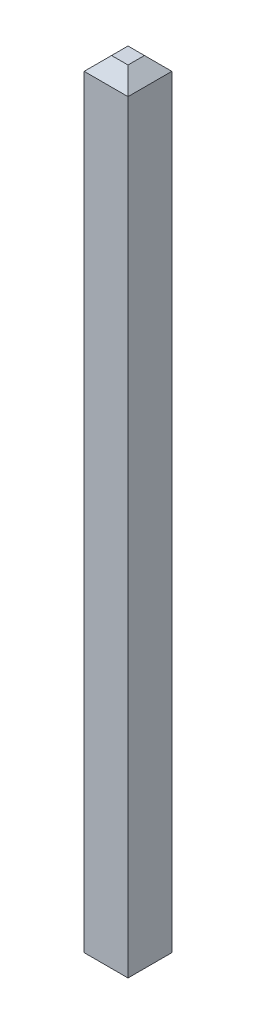
ISO-10303-21;
HEADER;
FILE_DESCRIPTION(('STEP AP214'),'2;1');
FILE_NAME('part.step','',(''),(''),'','','');
FILE_SCHEMA(('AUTOMOTIVE_DESIGN { 1 0 10303 214 1 1 1 1 }'));
ENDSEC;
DATA;
#1=APPLICATION_CONTEXT('core data for automotive mechanical design processes');
#2=APPLICATION_PROTOCOL_DEFINITION('international standard','automotive_design',2000,#1);
#3=PRODUCT_CONTEXT('',#1,'mechanical');
#4=PRODUCT('Part','Part','',(#3));
#5=PRODUCT_RELATED_PRODUCT_CATEGORY('part','',(#4));
#6=PRODUCT_DEFINITION_FORMATION('','',#4);
#7=PRODUCT_DEFINITION_CONTEXT('part definition',#1,'design');
#8=PRODUCT_DEFINITION('design','',#6,#7);
#9=PRODUCT_DEFINITION_SHAPE('','',#8);
#10=(LENGTH_UNIT() NAMED_UNIT(*) SI_UNIT(.MILLI.,.METRE.));
#11=(NAMED_UNIT(*) PLANE_ANGLE_UNIT() SI_UNIT($,.RADIAN.));
#12=(NAMED_UNIT(*) SI_UNIT($,.STERADIAN.) SOLID_ANGLE_UNIT());
#13=UNCERTAINTY_MEASURE_WITH_UNIT(LENGTH_MEASURE(1.E-05),#10,'distance_accuracy_value','');
#14=(GEOMETRIC_REPRESENTATION_CONTEXT(3) GLOBAL_UNCERTAINTY_ASSIGNED_CONTEXT((#13)) GLOBAL_UNIT_ASSIGNED_CONTEXT((#10,
#11,#12)) REPRESENTATION_CONTEXT('',''));
#15=CARTESIAN_POINT('',(0.,0.,0.));
#16=DIRECTION('',(0.,0.,1.));
#17=DIRECTION('',(1.,0.,0.));
#18=AXIS2_PLACEMENT_3D('',#15,#16,#17);
#19=CARTESIAN_POINT('',(1.59,7.07,-0.32));
#20=DIRECTION('',(-0.707106781186548,-0.707106781186548,0.));
#21=DIRECTION('',(-0.707106781186548,0.707106781186548,0.));
#22=AXIS2_PLACEMENT_3D('',#19,#20,#21);
#23=PLANE('',#22);
#24=DIRECTION('',(0.577350269189626,-0.577350269189626,0.577350269189626));
#25=VECTOR('',#24,1.);
#26=CARTESIAN_POINT('',(1.376666666667,7.283333333333,0.106666666667));
#27=LINE('',#26,#25);
#28=CARTESIAN_POINT('',(1.39,7.27,0.12));
#29=VERTEX_POINT('',#28);
#30=CARTESIAN_POINT('',(1.59,7.07,0.32));
#31=VERTEX_POINT('',#30);
#32=EDGE_CURVE('E160',#29,#31,#27,.T.);
#33=ORIENTED_EDGE('',*,*,#32,.T.);
#34=DIRECTION('',(0.,0.,1.));
#35=VECTOR('',#34,1.);
#36=CARTESIAN_POINT('',(1.59,7.07,-0.32));
#37=LINE('',#36,#35);
#38=CARTESIAN_POINT('',(1.59,7.07,-0.32));
#39=VERTEX_POINT('',#38);
#40=EDGE_CURVE('E161',#39,#31,#37,.T.);
#41=ORIENTED_EDGE('',*,*,#40,.F.);
#42=DIRECTION('',(0.577350269189626,-0.577350269189626,-0.577350269189626));
#43=VECTOR('',#42,1.);
#44=CARTESIAN_POINT('',(1.59,7.07,-0.32));
#45=LINE('',#44,#43);
#46=CARTESIAN_POINT('',(1.39,7.27,-0.12));
#47=VERTEX_POINT('',#46);
#48=EDGE_CURVE('E11',#47,#39,#45,.T.);
#49=ORIENTED_EDGE('',*,*,#48,.F.);
#50=DIRECTION('',(0.,0.,-1.));
#51=VECTOR('',#50,1.);
#52=CARTESIAN_POINT('',(1.39,7.27,-0.32));
#53=LINE('',#52,#51);
#54=EDGE_CURVE('E141',#29,#47,#53,.T.);
#55=ORIENTED_EDGE('',*,*,#54,.F.);
#56=EDGE_LOOP('',(#33,#41,#49,#55));
#57=FACE_BOUND('',#56,.T.);
#58=ADVANCED_FACE('F16',(#57),#23,.F.);
#59=CARTESIAN_POINT('',(1.27,7.07,-0.32));
#60=DIRECTION('',(0.,0.707106781186548,-0.707106781186548));
#61=DIRECTION('',(-1.,0.,0.));
#62=AXIS2_PLACEMENT_3D('',#59,#60,#61);
#63=PLANE('',#62);
#64=DIRECTION('',(0.577350269189626,0.577350269189626,0.577350269189626));
#65=VECTOR('',#64,1.);
#66=CARTESIAN_POINT('',(1.083333333333,7.203333333333,-0.186666666667));
#67=LINE('',#66,#65);
#68=CARTESIAN_POINT('',(0.95,7.07,-0.32));
#69=VERTEX_POINT('',#68);
#70=CARTESIAN_POINT('',(1.15,7.27,-0.12));
#71=VERTEX_POINT('',#70);
#72=EDGE_CURVE('E27',#69,#71,#67,.T.);
#73=ORIENTED_EDGE('',*,*,#72,.T.);
#74=DIRECTION('',(-1.,0.,0.));
#75=VECTOR('',#74,1.);
#76=CARTESIAN_POINT('',(0.95,7.27,-0.12));
#77=LINE('',#76,#75);
#78=EDGE_CURVE('E137',#47,#71,#77,.T.);
#79=ORIENTED_EDGE('',*,*,#78,.F.);
#80=ORIENTED_EDGE('',*,*,#48,.T.);
#81=DIRECTION('',(1.,0.,0.));
#82=VECTOR('',#81,1.);
#83=CARTESIAN_POINT('',(1.59,7.07,-0.32));
#84=LINE('',#83,#82);
#85=EDGE_CURVE('E112',#69,#39,#84,.T.);
#86=ORIENTED_EDGE('',*,*,#85,.F.);
#87=EDGE_LOOP('',(#73,#79,#80,#86));
#88=FACE_BOUND('',#87,.T.);
#89=ADVANCED_FACE('F203',(#88),#63,.T.);
#90=CARTESIAN_POINT('',(1.15,7.27,-0.32));
#91=DIRECTION('',(0.707106781186548,-0.707106781186548,0.));
#92=DIRECTION('',(0.,0.,-1.));
#93=AXIS2_PLACEMENT_3D('',#90,#91,#92);
#94=PLANE('',#93);
#95=DIRECTION('',(-0.577350269189626,-0.577350269189626,0.577350269189626));
#96=VECTOR('',#95,1.);
#97=CARTESIAN_POINT('',(1.083333333333,7.203333333333,0.186666666667));
#98=LINE('',#97,#96);
#99=CARTESIAN_POINT('',(1.15,7.27,0.12));
#100=VERTEX_POINT('',#99);
#101=CARTESIAN_POINT('',(0.95,7.07,0.32));
#102=VERTEX_POINT('',#101);
#103=EDGE_CURVE('E41',#100,#102,#98,.T.);
#104=ORIENTED_EDGE('',*,*,#103,.F.);
#105=DIRECTION('',(0.,0.,1.));
#106=VECTOR('',#105,1.);
#107=CARTESIAN_POINT('',(1.15,7.27,-0.32));
#108=LINE('',#107,#106);
#109=EDGE_CURVE('E140',#71,#100,#108,.T.);
#110=ORIENTED_EDGE('',*,*,#109,.F.);
#111=ORIENTED_EDGE('',*,*,#72,.F.);
#112=DIRECTION('',(0.,0.,-1.));
#113=VECTOR('',#112,1.);
#114=CARTESIAN_POINT('',(0.95,7.07,-0.32));
#115=LINE('',#114,#113);
#116=EDGE_CURVE('E176',#102,#69,#115,.T.);
#117=ORIENTED_EDGE('',*,*,#116,.F.);
#118=EDGE_LOOP('',(#104,#110,#111,#117));
#119=FACE_BOUND('',#118,.T.);
#120=ADVANCED_FACE('F204',(#119),#94,.F.);
#121=CARTESIAN_POINT('',(0.95,7.27,0.12));
#122=DIRECTION('',(0.,-0.707106781186548,-0.707106781186548));
#123=DIRECTION('',(0.,-0.707106781186548,0.707106781186548));
#124=AXIS2_PLACEMENT_3D('',#121,#122,#123);
#125=PLANE('',#124);
#126=ORIENTED_EDGE('',*,*,#32,.F.);
#127=DIRECTION('',(1.,0.,0.));
#128=VECTOR('',#127,1.);
#129=CARTESIAN_POINT('',(0.95,7.27,0.12));
#130=LINE('',#129,#128);
#131=EDGE_CURVE('E166',#100,#29,#130,.T.);
#132=ORIENTED_EDGE('',*,*,#131,.F.);
#133=ORIENTED_EDGE('',*,*,#103,.T.);
#134=DIRECTION('',(-1.,0.,0.));
#135=VECTOR('',#134,1.);
#136=CARTESIAN_POINT('',(1.27,7.07,0.32));
#137=LINE('',#136,#135);
#138=EDGE_CURVE('E150',#31,#102,#137,.T.);
#139=ORIENTED_EDGE('',*,*,#138,.F.);
#140=EDGE_LOOP('',(#126,#132,#133,#139));
#141=FACE_BOUND('',#140,.T.);
#142=ADVANCED_FACE('F215',(#141),#125,.F.);
#143=CARTESIAN_POINT('',(0.95,7.27,-0.32));
#144=DIRECTION('',(0.,-1.,0.));
#145=DIRECTION('',(0.,0.,-1.));
#146=AXIS2_PLACEMENT_3D('',#143,#144,#145);
#147=PLANE('',#146);
#148=ORIENTED_EDGE('',*,*,#54,.T.);
#149=ORIENTED_EDGE('',*,*,#78,.T.);
#150=ORIENTED_EDGE('',*,*,#109,.T.);
#151=ORIENTED_EDGE('',*,*,#131,.T.);
#152=EDGE_LOOP('',(#148,#149,#150,#151));
#153=FACE_BOUND('',#152,.T.);
#154=ADVANCED_FACE('F206',(#153),#147,.F.);
#155=CARTESIAN_POINT('',(1.59,7.27,-0.32));
#156=DIRECTION('',(-1.,0.,0.));
#157=DIRECTION('',(0.,1.,0.));
#158=AXIS2_PLACEMENT_3D('',#155,#156,#157);
#159=PLANE('',#158);
#160=DIRECTION('',(0.,-1.,0.));
#161=VECTOR('',#160,1.);
#162=CARTESIAN_POINT('',(1.59,7.27,-0.32));
#163=LINE('',#162,#161);
#164=CARTESIAN_POINT('',(1.59,-4.07,-0.32));
#165=VERTEX_POINT('',#164);
#166=EDGE_CURVE('E93',#39,#165,#163,.T.);
#167=ORIENTED_EDGE('',*,*,#166,.F.);
#168=ORIENTED_EDGE('',*,*,#40,.T.);
#169=DIRECTION('',(0.,-1.,0.));
#170=VECTOR('',#169,1.);
#171=CARTESIAN_POINT('',(1.59,7.27,0.32));
#172=LINE('',#171,#170);
#173=CARTESIAN_POINT('',(1.59,-4.07,0.32));
#174=VERTEX_POINT('',#173);
#175=EDGE_CURVE('E96',#31,#174,#172,.T.);
#176=ORIENTED_EDGE('',*,*,#175,.T.);
#177=DIRECTION('',(0.,0.,-1.));
#178=VECTOR('',#177,1.);
#179=CARTESIAN_POINT('',(1.59,-4.07,-0.32));
#180=LINE('',#179,#178);
#181=EDGE_CURVE('E90',#174,#165,#180,.T.);
#182=ORIENTED_EDGE('',*,*,#181,.T.);
#183=EDGE_LOOP('',(#167,#168,#176,#182));
#184=FACE_BOUND('',#183,.T.);
#185=ADVANCED_FACE('F18',(#184),#159,.F.);
#186=CARTESIAN_POINT('',(1.27,1.5,0.32));
#187=DIRECTION('',(0.,0.,-1.));
#188=DIRECTION('',(0.,-1.,0.));
#189=AXIS2_PLACEMENT_3D('',#186,#187,#188);
#190=PLANE('',#189);
#191=ORIENTED_EDGE('',*,*,#175,.F.);
#192=ORIENTED_EDGE('',*,*,#138,.T.);
#193=DIRECTION('',(0.,1.,0.));
#194=VECTOR('',#193,1.);
#195=CARTESIAN_POINT('',(0.95,-4.27,0.32));
#196=LINE('',#195,#194);
#197=CARTESIAN_POINT('',(0.95,-4.07,0.32));
#198=VERTEX_POINT('',#197);
#199=EDGE_CURVE('E20',#198,#102,#196,.T.);
#200=ORIENTED_EDGE('',*,*,#199,.F.);
#201=DIRECTION('',(1.,0.,0.));
#202=VECTOR('',#201,1.);
#203=CARTESIAN_POINT('',(1.27,-4.07,0.32));
#204=LINE('',#203,#202);
#205=EDGE_CURVE('E102',#198,#174,#204,.T.);
#206=ORIENTED_EDGE('',*,*,#205,.T.);
#207=EDGE_LOOP('',(#191,#192,#200,#206));
#208=FACE_BOUND('',#207,.T.);
#209=ADVANCED_FACE('F218',(#208),#190,.F.);
#210=CARTESIAN_POINT('',(1.39,-4.27,-0.32));
#211=DIRECTION('',(-0.707106781186548,0.707106781186548,0.));
#212=DIRECTION('',(0.,0.,1.));
#213=AXIS2_PLACEMENT_3D('',#210,#211,#212);
#214=PLANE('',#213);
#215=DIRECTION('',(-0.577350269189626,-0.577350269189626,0.577350269189626));
#216=VECTOR('',#215,1.);
#217=CARTESIAN_POINT('',(1.456666666667,-4.203333333333,-0.186666666667));
#218=LINE('',#217,#216);
#219=CARTESIAN_POINT('',(1.39,-4.27,-0.12));
#220=VERTEX_POINT('',#219);
#221=EDGE_CURVE('E116',#165,#220,#218,.T.);
#222=ORIENTED_EDGE('',*,*,#221,.F.);
#223=ORIENTED_EDGE('',*,*,#181,.F.);
#224=DIRECTION('',(-0.577350269189626,-0.577350269189626,-0.577350269189626));
#225=VECTOR('',#224,1.);
#226=CARTESIAN_POINT('',(1.243333333333,-4.416666666667,-0.02666666666667));
#227=LINE('',#226,#225);
#228=CARTESIAN_POINT('',(1.39,-4.27,0.12));
#229=VERTEX_POINT('',#228);
#230=EDGE_CURVE('E152',#174,#229,#227,.T.);
#231=ORIENTED_EDGE('',*,*,#230,.T.);
#232=DIRECTION('',(0.,0.,1.));
#233=VECTOR('',#232,1.);
#234=CARTESIAN_POINT('',(1.39,-4.27,-0.32));
#235=LINE('',#234,#233);
#236=EDGE_CURVE('E119',#220,#229,#235,.T.);
#237=ORIENTED_EDGE('',*,*,#236,.F.);
#238=EDGE_LOOP('',(#222,#223,#231,#237));
#239=FACE_BOUND('',#238,.T.);
#240=ADVANCED_FACE('F117',(#239),#214,.F.);
#241=CARTESIAN_POINT('',(1.59,-4.27,0.12));
#242=DIRECTION('',(0.,0.707106781186548,-0.707106781186548));
#243=DIRECTION('',(-1.,0.,0.));
#244=AXIS2_PLACEMENT_3D('',#241,#242,#243);
#245=PLANE('',#244);
#246=ORIENTED_EDGE('',*,*,#230,.F.);
#247=ORIENTED_EDGE('',*,*,#205,.F.);
#248=DIRECTION('',(-0.577350269189626,0.577350269189626,0.577350269189626));
#249=VECTOR('',#248,1.);
#250=CARTESIAN_POINT('',(1.163333333333,-4.283333333333,0.106666666667));
#251=LINE('',#250,#249);
#252=CARTESIAN_POINT('',(1.15,-4.27,0.12));
#253=VERTEX_POINT('',#252);
#254=EDGE_CURVE('E155',#253,#198,#251,.T.);
#255=ORIENTED_EDGE('',*,*,#254,.F.);
#256=DIRECTION('',(-1.,0.,0.));
#257=VECTOR('',#256,1.);
#258=CARTESIAN_POINT('',(1.59,-4.27,0.12));
#259=LINE('',#258,#257);
#260=EDGE_CURVE('E142',#229,#253,#259,.T.);
#261=ORIENTED_EDGE('',*,*,#260,.F.);
#262=EDGE_LOOP('',(#246,#247,#255,#261));
#263=FACE_BOUND('',#262,.T.);
#264=ADVANCED_FACE('F224',(#263),#245,.F.);
#265=CARTESIAN_POINT('',(0.95,-4.07,-0.32));
#266=DIRECTION('',(0.707106781186548,0.707106781186548,0.));
#267=DIRECTION('',(0.,0.,-1.));
#268=AXIS2_PLACEMENT_3D('',#265,#266,#267);
#269=PLANE('',#268);
#270=DIRECTION('',(0.577350269189626,-0.577350269189626,0.577350269189626));
#271=VECTOR('',#270,1.);
#272=CARTESIAN_POINT('',(1.056666666667,-4.176666666667,-0.213333333333));
#273=LINE('',#272,#271);
#274=CARTESIAN_POINT('',(0.95,-4.07,-0.32));
#275=VERTEX_POINT('',#274);
#276=CARTESIAN_POINT('',(1.15,-4.27,-0.12));
#277=VERTEX_POINT('',#276);
#278=EDGE_CURVE('E128',#275,#277,#273,.T.);
#279=ORIENTED_EDGE('',*,*,#278,.T.);
#280=DIRECTION('',(0.,0.,-1.));
#281=VECTOR('',#280,1.);
#282=CARTESIAN_POINT('',(1.15,-4.27,-0.32));
#283=LINE('',#282,#281);
#284=EDGE_CURVE('E146',#253,#277,#283,.T.);
#285=ORIENTED_EDGE('',*,*,#284,.F.);
#286=ORIENTED_EDGE('',*,*,#254,.T.);
#287=DIRECTION('',(0.,0.,1.));
#288=VECTOR('',#287,1.);
#289=CARTESIAN_POINT('',(0.95,-4.07,-0.32));
#290=LINE('',#289,#288);
#291=EDGE_CURVE('E172',#275,#198,#290,.T.);
#292=ORIENTED_EDGE('',*,*,#291,.F.);
#293=EDGE_LOOP('',(#279,#285,#286,#292));
#294=FACE_BOUND('',#293,.T.);
#295=ADVANCED_FACE('F232',(#294),#269,.F.);
#296=CARTESIAN_POINT('',(0.95,-4.27,-0.32));
#297=DIRECTION('',(1.,0.,0.));
#298=DIRECTION('',(0.,0.,1.));
#299=AXIS2_PLACEMENT_3D('',#296,#297,#298);
#300=PLANE('',#299);
#301=ORIENTED_EDGE('',*,*,#199,.T.);
#302=ORIENTED_EDGE('',*,*,#116,.T.);
#303=DIRECTION('',(0.,1.,0.));
#304=VECTOR('',#303,1.);
#305=CARTESIAN_POINT('',(0.95,-4.27,-0.32));
#306=LINE('',#305,#304);
#307=EDGE_CURVE('E124',#275,#69,#306,.T.);
#308=ORIENTED_EDGE('',*,*,#307,.F.);
#309=ORIENTED_EDGE('',*,*,#291,.T.);
#310=EDGE_LOOP('',(#301,#302,#308,#309));
#311=FACE_BOUND('',#310,.T.);
#312=ADVANCED_FACE('F253',(#311),#300,.F.);
#313=CARTESIAN_POINT('',(1.27,1.5,-0.32));
#314=DIRECTION('',(0.,0.,-1.));
#315=DIRECTION('',(0.,-1.,0.));
#316=AXIS2_PLACEMENT_3D('',#313,#314,#315);
#317=PLANE('',#316);
#318=ORIENTED_EDGE('',*,*,#307,.T.);
#319=ORIENTED_EDGE('',*,*,#85,.T.);
#320=ORIENTED_EDGE('',*,*,#166,.T.);
#321=DIRECTION('',(-1.,0.,0.));
#322=VECTOR('',#321,1.);
#323=CARTESIAN_POINT('',(0.95,-4.07,-0.32));
#324=LINE('',#323,#322);
#325=EDGE_CURVE('E109',#165,#275,#324,.T.);
#326=ORIENTED_EDGE('',*,*,#325,.T.);
#327=EDGE_LOOP('',(#318,#319,#320,#326));
#328=FACE_BOUND('',#327,.T.);
#329=ADVANCED_FACE('F107',(#328),#317,.T.);
#330=CARTESIAN_POINT('',(1.27,-4.07,-0.32));
#331=DIRECTION('',(0.,-0.707106781186548,-0.707106781186548));
#332=DIRECTION('',(0.,-0.707106781186548,0.707106781186548));
#333=AXIS2_PLACEMENT_3D('',#330,#331,#332);
#334=PLANE('',#333);
#335=ORIENTED_EDGE('',*,*,#278,.F.);
#336=ORIENTED_EDGE('',*,*,#325,.F.);
#337=ORIENTED_EDGE('',*,*,#221,.T.);
#338=DIRECTION('',(1.,0.,0.));
#339=VECTOR('',#338,1.);
#340=CARTESIAN_POINT('',(1.59,-4.27,-0.12));
#341=LINE('',#340,#339);
#342=EDGE_CURVE('E134',#277,#220,#341,.T.);
#343=ORIENTED_EDGE('',*,*,#342,.F.);
#344=EDGE_LOOP('',(#335,#336,#337,#343));
#345=FACE_BOUND('',#344,.T.);
#346=ADVANCED_FACE('F126',(#345),#334,.T.);
#347=CARTESIAN_POINT('',(1.59,-4.27,-0.32));
#348=DIRECTION('',(0.,1.,0.));
#349=DIRECTION('',(0.,0.,-1.));
#350=AXIS2_PLACEMENT_3D('',#347,#348,#349);
#351=PLANE('',#350);
#352=ORIENTED_EDGE('',*,*,#236,.T.);
#353=ORIENTED_EDGE('',*,*,#260,.T.);
#354=ORIENTED_EDGE('',*,*,#284,.T.);
#355=ORIENTED_EDGE('',*,*,#342,.T.);
#356=EDGE_LOOP('',(#352,#353,#354,#355));
#357=FACE_BOUND('',#356,.T.);
#358=ADVANCED_FACE('F235',(#357),#351,.F.);
#359=CLOSED_SHELL('',(#58,#89,#120,#142,#154,#185,#209,#240,#264,#295,#312,#329,#346,#358));
#360=MANIFOLD_SOLID_BREP('B1',#359);
#361=ADVANCED_BREP_SHAPE_REPRESENTATION('',(#18,#360),#14);
#362=SHAPE_DEFINITION_REPRESENTATION(#9,#361);
ENDSEC;
END-ISO-10303-21;
